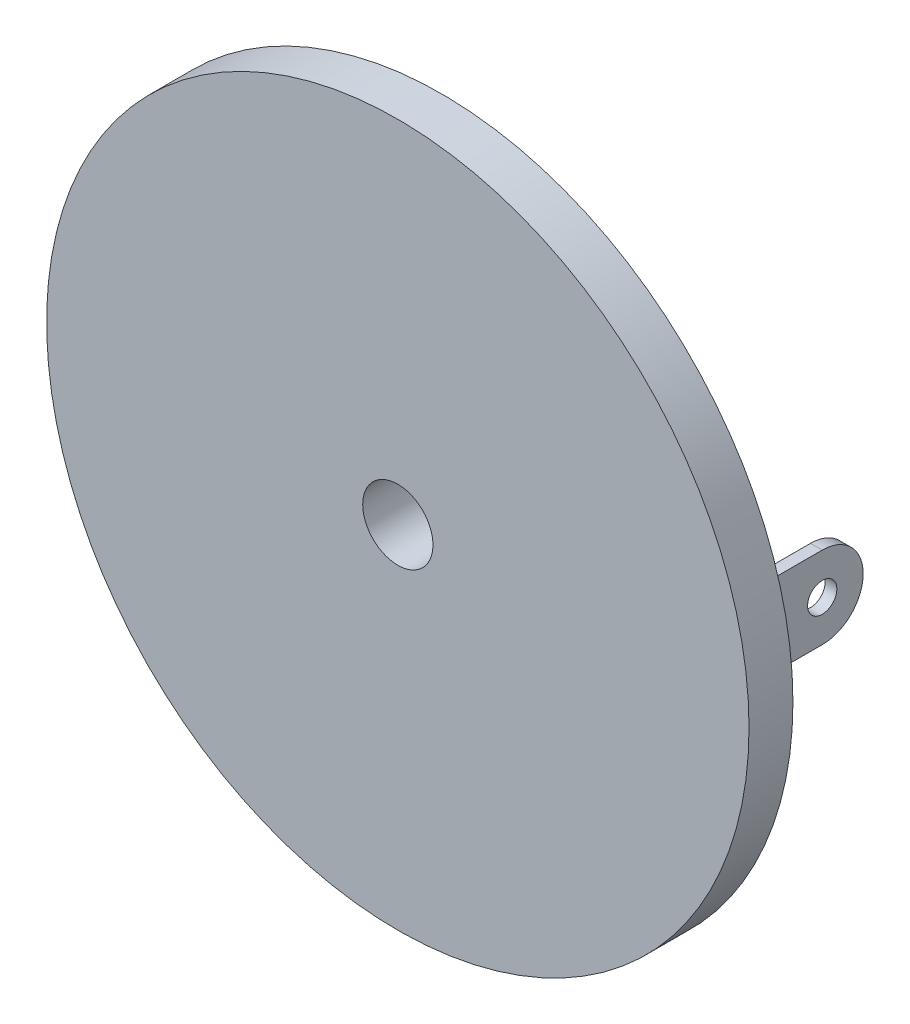
ISO-10303-21;
HEADER;
FILE_DESCRIPTION(('STEP AP214'),'2;1');
FILE_NAME('part.step','',(''),(''),'','','');
FILE_SCHEMA(('AUTOMOTIVE_DESIGN { 1 0 10303 214 1 1 1 1 }'));
ENDSEC;
DATA;
#1=APPLICATION_CONTEXT('core data for automotive mechanical design processes');
#2=APPLICATION_PROTOCOL_DEFINITION('international standard','automotive_design',2000,#1);
#3=PRODUCT_CONTEXT('',#1,'mechanical');
#4=PRODUCT('Part','Part','',(#3));
#5=PRODUCT_RELATED_PRODUCT_CATEGORY('part','',(#4));
#6=PRODUCT_DEFINITION_FORMATION('','',#4);
#7=PRODUCT_DEFINITION_CONTEXT('part definition',#1,'design');
#8=PRODUCT_DEFINITION('design','',#6,#7);
#9=PRODUCT_DEFINITION_SHAPE('','',#8);
#10=(LENGTH_UNIT() NAMED_UNIT(*) SI_UNIT(.MILLI.,.METRE.));
#11=(NAMED_UNIT(*) PLANE_ANGLE_UNIT() SI_UNIT($,.RADIAN.));
#12=(NAMED_UNIT(*) SI_UNIT($,.STERADIAN.) SOLID_ANGLE_UNIT());
#13=UNCERTAINTY_MEASURE_WITH_UNIT(LENGTH_MEASURE(1.E-05),#10,'distance_accuracy_value','');
#14=(GEOMETRIC_REPRESENTATION_CONTEXT(3) GLOBAL_UNCERTAINTY_ASSIGNED_CONTEXT((#13)) GLOBAL_UNIT_ASSIGNED_CONTEXT((#10,
#11,#12)) REPRESENTATION_CONTEXT('',''));
#15=CARTESIAN_POINT('',(0.,0.,0.));
#16=DIRECTION('',(0.,0.,1.));
#17=DIRECTION('',(1.,0.,0.));
#18=AXIS2_PLACEMENT_3D('',#15,#16,#17);
#19=CARTESIAN_POINT('',(0.,0.,0.));
#20=DIRECTION('',(0.,0.,1.));
#21=DIRECTION('',(1.,0.,0.));
#22=AXIS2_PLACEMENT_3D('',#19,#20,#21);
#23=PLANE('',#22);
#24=DIRECTION('',(0.,1.,0.));
#25=VECTOR('',#24,1.);
#26=CARTESIAN_POINT('',(-9.4,1.4,0.));
#27=LINE('',#26,#25);
#28=CARTESIAN_POINT('',(-9.4,-1.4,0.));
#29=VERTEX_POINT('',#28);
#30=CARTESIAN_POINT('',(-9.4,1.4,0.));
#31=VERTEX_POINT('',#30);
#32=EDGE_CURVE('E218',#29,#31,#27,.T.);
#33=ORIENTED_EDGE('',*,*,#32,.F.);
#34=DIRECTION('',(-1.,0.,0.));
#35=VECTOR('',#34,1.);
#36=CARTESIAN_POINT('',(-9.4,-1.4,0.));
#37=LINE('',#36,#35);
#38=CARTESIAN_POINT('',(-9.,-1.4,0.));
#39=VERTEX_POINT('',#38);
#40=EDGE_CURVE('E227',#39,#29,#37,.T.);
#41=ORIENTED_EDGE('',*,*,#40,.F.);
#42=DIRECTION('',(0.,-1.,0.));
#43=VECTOR('',#42,1.);
#44=CARTESIAN_POINT('',(-9.,1.4,0.));
#45=LINE('',#44,#43);
#46=CARTESIAN_POINT('',(-9.,1.4,0.));
#47=VERTEX_POINT('',#46);
#48=EDGE_CURVE('E224',#47,#39,#45,.T.);
#49=ORIENTED_EDGE('',*,*,#48,.F.);
#50=DIRECTION('',(1.,0.,0.));
#51=VECTOR('',#50,1.);
#52=CARTESIAN_POINT('',(-9.4,1.4,0.));
#53=LINE('',#52,#51);
#54=EDGE_CURVE('E221',#31,#47,#53,.T.);
#55=ORIENTED_EDGE('',*,*,#54,.F.);
#56=EDGE_LOOP('',(#33,#41,#49,#55));
#57=FACE_BOUND('',#56,.T.);
#58=CARTESIAN_POINT('',(0.,0.,0.));
#59=DIRECTION('',(0.,0.,1.));
#60=DIRECTION('',(1.,0.,0.));
#61=AXIS2_PLACEMENT_3D('',#58,#59,#60);
#62=CIRCLE('',#61,12.);
#63=CARTESIAN_POINT('',(12.,0.,0.));
#64=VERTEX_POINT('',#63);
#65=EDGE_CURVE('E119',#64,#64,#62,.T.);
#66=ORIENTED_EDGE('',*,*,#65,.F.);
#67=EDGE_LOOP('',(#66));
#68=FACE_BOUND('',#67,.T.);
#69=DIRECTION('',(0.,-1.,0.));
#70=VECTOR('',#69,1.);
#71=CARTESIAN_POINT('',(9.4,1.4,0.));
#72=LINE('',#71,#70);
#73=CARTESIAN_POINT('',(9.4,1.4,0.));
#74=VERTEX_POINT('',#73);
#75=CARTESIAN_POINT('',(9.4,-1.4,0.));
#76=VERTEX_POINT('',#75);
#77=EDGE_CURVE('E118',#74,#76,#72,.T.);
#78=ORIENTED_EDGE('',*,*,#77,.F.);
#79=DIRECTION('',(1.,0.,0.));
#80=VECTOR('',#79,1.);
#81=CARTESIAN_POINT('',(9.4,1.4,0.));
#82=LINE('',#81,#80);
#83=CARTESIAN_POINT('',(9.,1.4,0.));
#84=VERTEX_POINT('',#83);
#85=EDGE_CURVE('E244',#84,#74,#82,.T.);
#86=ORIENTED_EDGE('',*,*,#85,.F.);
#87=DIRECTION('',(0.,1.,0.));
#88=VECTOR('',#87,1.);
#89=CARTESIAN_POINT('',(9.,1.4,0.));
#90=LINE('',#89,#88);
#91=CARTESIAN_POINT('',(9.,-1.4,0.));
#92=VERTEX_POINT('',#91);
#93=EDGE_CURVE('E241',#92,#84,#90,.T.);
#94=ORIENTED_EDGE('',*,*,#93,.F.);
#95=DIRECTION('',(-1.,0.,0.));
#96=VECTOR('',#95,1.);
#97=CARTESIAN_POINT('',(9.4,-1.4,0.));
#98=LINE('',#97,#96);
#99=EDGE_CURVE('E239',#76,#92,#98,.T.);
#100=ORIENTED_EDGE('',*,*,#99,.F.);
#101=EDGE_LOOP('',(#78,#86,#94,#100));
#102=FACE_BOUND('',#101,.T.);
#103=CARTESIAN_POINT('',(0.,0.,0.));
#104=DIRECTION('',(0.,0.,1.));
#105=DIRECTION('',(1.,0.,0.));
#106=AXIS2_PLACEMENT_3D('',#103,#104,#105);
#107=CIRCLE('',#106,4.2);
#108=CARTESIAN_POINT('',(4.2,0.,0.));
#109=VERTEX_POINT('',#108);
#110=EDGE_CURVE('E11',#109,#109,#107,.F.);
#111=ORIENTED_EDGE('',*,*,#110,.F.);
#112=EDGE_LOOP('',(#111));
#113=FACE_BOUND('',#112,.T.);
#114=ADVANCED_FACE('F32',(#57,#68,#102,#113),#23,.F.);
#115=CARTESIAN_POINT('',(0.,0.,1.5));
#116=DIRECTION('',(0.,0.,-1.));
#117=DIRECTION('',(-1.,0.,0.));
#118=AXIS2_PLACEMENT_3D('',#115,#116,#117);
#119=CYLINDRICAL_SURFACE('',#118,12.);
#120=CARTESIAN_POINT('',(0.,0.,1.5));
#121=DIRECTION('',(0.,0.,1.));
#122=DIRECTION('',(1.,0.,0.));
#123=AXIS2_PLACEMENT_3D('',#120,#121,#122);
#124=CIRCLE('',#123,12.);
#125=CARTESIAN_POINT('',(12.,0.,1.5));
#126=VERTEX_POINT('',#125);
#127=EDGE_CURVE('E41',#126,#126,#124,.T.);
#128=ORIENTED_EDGE('',*,*,#127,.F.);
#129=EDGE_LOOP('',(#128));
#130=FACE_BOUND('',#129,.T.);
#131=ORIENTED_EDGE('',*,*,#65,.T.);
#132=EDGE_LOOP('',(#131));
#133=FACE_BOUND('',#132,.T.);
#134=ADVANCED_FACE('F34',(#130,#133),#119,.T.);
#135=CARTESIAN_POINT('',(0.,0.,1.5));
#136=DIRECTION('',(0.,0.,1.));
#137=DIRECTION('',(1.,0.,0.));
#138=AXIS2_PLACEMENT_3D('',#135,#136,#137);
#139=PLANE('',#138);
#140=CARTESIAN_POINT('',(0.,0.,1.5));
#141=DIRECTION('',(0.,0.,-1.));
#142=DIRECTION('',(-1.,0.,0.));
#143=AXIS2_PLACEMENT_3D('',#140,#141,#142);
#144=CIRCLE('',#143,1.2);
#145=CARTESIAN_POINT('',(-1.2,0.,1.5));
#146=VERTEX_POINT('',#145);
#147=EDGE_CURVE('E104',#146,#146,#144,.T.);
#148=ORIENTED_EDGE('',*,*,#147,.T.);
#149=EDGE_LOOP('',(#148));
#150=FACE_BOUND('',#149,.T.);
#151=ORIENTED_EDGE('',*,*,#127,.T.);
#152=EDGE_LOOP('',(#151));
#153=FACE_BOUND('',#152,.T.);
#154=ADVANCED_FACE('F130',(#150,#153),#139,.T.);
#155=CARTESIAN_POINT('',(9.4,1.4,-5.));
#156=DIRECTION('',(-1.,0.,0.));
#157=DIRECTION('',(0.,0.,1.));
#158=AXIS2_PLACEMENT_3D('',#155,#156,#157);
#159=PLANE('',#158);
#160=CARTESIAN_POINT('',(9.4,0.,-3.6));
#161=DIRECTION('',(1.,0.,0.));
#162=DIRECTION('',(0.,0.,-1.));
#163=AXIS2_PLACEMENT_3D('',#160,#161,#162);
#164=CIRCLE('',#163,0.500000000000001);
#165=CARTESIAN_POINT('',(9.4,0.,-4.1));
#166=VERTEX_POINT('',#165);
#167=EDGE_CURVE('E206',#166,#166,#164,.T.);
#168=ORIENTED_EDGE('',*,*,#167,.F.);
#169=EDGE_LOOP('',(#168));
#170=FACE_BOUND('',#169,.T.);
#171=DIRECTION('',(0.,0.,1.));
#172=VECTOR('',#171,1.);
#173=CARTESIAN_POINT('',(9.4,-1.4,-5.));
#174=LINE('',#173,#172);
#175=CARTESIAN_POINT('',(9.4,-1.4,-3.6));
#176=VERTEX_POINT('',#175);
#177=EDGE_CURVE('E110',#176,#76,#174,.T.);
#178=ORIENTED_EDGE('',*,*,#177,.F.);
#179=CARTESIAN_POINT('',(9.4,0.,-3.6));
#180=DIRECTION('',(-1.,0.,0.));
#181=DIRECTION('',(0.,0.,-1.));
#182=AXIS2_PLACEMENT_3D('',#179,#180,#181);
#183=CIRCLE('',#182,1.4);
#184=CARTESIAN_POINT('',(9.4,1.4,-3.6));
#185=VERTEX_POINT('',#184);
#186=EDGE_CURVE('E96',#185,#176,#183,.T.);
#187=ORIENTED_EDGE('',*,*,#186,.F.);
#188=DIRECTION('',(0.,0.,1.));
#189=VECTOR('',#188,1.);
#190=CARTESIAN_POINT('',(9.4,1.4,-5.));
#191=LINE('',#190,#189);
#192=EDGE_CURVE('E246',#185,#74,#191,.T.);
#193=ORIENTED_EDGE('',*,*,#192,.T.);
#194=ORIENTED_EDGE('',*,*,#77,.T.);
#195=EDGE_LOOP('',(#178,#187,#193,#194));
#196=FACE_BOUND('',#195,.T.);
#197=ADVANCED_FACE('F116',(#170,#196),#159,.F.);
#198=CARTESIAN_POINT('',(9.4,-1.4,-5.));
#199=DIRECTION('',(0.,1.,0.));
#200=DIRECTION('',(0.,0.,1.));
#201=AXIS2_PLACEMENT_3D('',#198,#199,#200);
#202=PLANE('',#201);
#203=DIRECTION('',(0.,0.,1.));
#204=VECTOR('',#203,1.);
#205=CARTESIAN_POINT('',(9.,-1.4,-5.));
#206=LINE('',#205,#204);
#207=CARTESIAN_POINT('',(9.,-1.4,-3.6));
#208=VERTEX_POINT('',#207);
#209=EDGE_CURVE('E112',#208,#92,#206,.T.);
#210=ORIENTED_EDGE('',*,*,#209,.F.);
#211=DIRECTION('',(1.,0.,0.));
#212=VECTOR('',#211,1.);
#213=CARTESIAN_POINT('',(-12.,-1.4,-3.6));
#214=LINE('',#213,#212);
#215=EDGE_CURVE('E99',#208,#176,#214,.T.);
#216=ORIENTED_EDGE('',*,*,#215,.T.);
#217=ORIENTED_EDGE('',*,*,#177,.T.);
#218=ORIENTED_EDGE('',*,*,#99,.T.);
#219=EDGE_LOOP('',(#210,#216,#217,#218));
#220=FACE_BOUND('',#219,.T.);
#221=ADVANCED_FACE('F108',(#220),#202,.F.);
#222=CARTESIAN_POINT('',(9.,1.4,-5.));
#223=DIRECTION('',(1.,0.,0.));
#224=DIRECTION('',(0.,0.,-1.));
#225=AXIS2_PLACEMENT_3D('',#222,#223,#224);
#226=PLANE('',#225);
#227=CARTESIAN_POINT('',(9.,0.,-3.6));
#228=DIRECTION('',(1.,0.,0.));
#229=DIRECTION('',(0.,0.,-1.));
#230=AXIS2_PLACEMENT_3D('',#227,#228,#229);
#231=CIRCLE('',#230,0.500000000000001);
#232=CARTESIAN_POINT('',(9.,0.,-4.1));
#233=VERTEX_POINT('',#232);
#234=EDGE_CURVE('E212',#233,#233,#231,.T.);
#235=ORIENTED_EDGE('',*,*,#234,.T.);
#236=EDGE_LOOP('',(#235));
#237=FACE_BOUND('',#236,.T.);
#238=DIRECTION('',(0.,0.,1.));
#239=VECTOR('',#238,1.);
#240=CARTESIAN_POINT('',(9.,1.4,-5.));
#241=LINE('',#240,#239);
#242=CARTESIAN_POINT('',(9.,1.4,-3.6));
#243=VERTEX_POINT('',#242);
#244=EDGE_CURVE('E123',#243,#84,#241,.T.);
#245=ORIENTED_EDGE('',*,*,#244,.F.);
#246=CARTESIAN_POINT('',(9.,0.,-3.6));
#247=DIRECTION('',(1.,0.,0.));
#248=DIRECTION('',(0.,0.,-1.));
#249=AXIS2_PLACEMENT_3D('',#246,#247,#248);
#250=CIRCLE('',#249,1.4);
#251=EDGE_CURVE('E48',#243,#208,#250,.F.);
#252=ORIENTED_EDGE('',*,*,#251,.T.);
#253=ORIENTED_EDGE('',*,*,#209,.T.);
#254=ORIENTED_EDGE('',*,*,#93,.T.);
#255=EDGE_LOOP('',(#245,#252,#253,#254));
#256=FACE_BOUND('',#255,.T.);
#257=ADVANCED_FACE('F178',(#237,#256),#226,.F.);
#258=CARTESIAN_POINT('',(9.4,1.4,-5.));
#259=DIRECTION('',(0.,-1.,0.));
#260=DIRECTION('',(0.,0.,-1.));
#261=AXIS2_PLACEMENT_3D('',#258,#259,#260);
#262=PLANE('',#261);
#263=ORIENTED_EDGE('',*,*,#192,.F.);
#264=DIRECTION('',(1.,0.,0.));
#265=VECTOR('',#264,1.);
#266=CARTESIAN_POINT('',(-12.,1.4,-3.6));
#267=LINE('',#266,#265);
#268=EDGE_CURVE('E100',#243,#185,#267,.T.);
#269=ORIENTED_EDGE('',*,*,#268,.F.);
#270=ORIENTED_EDGE('',*,*,#244,.T.);
#271=ORIENTED_EDGE('',*,*,#85,.T.);
#272=EDGE_LOOP('',(#263,#269,#270,#271));
#273=FACE_BOUND('',#272,.T.);
#274=ADVANCED_FACE('F174',(#273),#262,.F.);
#275=CARTESIAN_POINT('',(-9.4,1.4,-5.));
#276=DIRECTION('',(1.,0.,0.));
#277=DIRECTION('',(0.,0.,-1.));
#278=AXIS2_PLACEMENT_3D('',#275,#276,#277);
#279=PLANE('',#278);
#280=CARTESIAN_POINT('',(-9.4,0.,-3.6));
#281=DIRECTION('',(1.,0.,0.));
#282=DIRECTION('',(0.,0.,-1.));
#283=AXIS2_PLACEMENT_3D('',#280,#281,#282);
#284=CIRCLE('',#283,0.500000000000001);
#285=CARTESIAN_POINT('',(-9.4,0.,-4.1));
#286=VERTEX_POINT('',#285);
#287=EDGE_CURVE('E209',#286,#286,#284,.T.);
#288=ORIENTED_EDGE('',*,*,#287,.T.);
#289=EDGE_LOOP('',(#288));
#290=FACE_BOUND('',#289,.T.);
#291=DIRECTION('',(0.,0.,1.));
#292=VECTOR('',#291,1.);
#293=CARTESIAN_POINT('',(-9.4,1.4,-5.));
#294=LINE('',#293,#292);
#295=CARTESIAN_POINT('',(-9.4,1.4,-3.6));
#296=VERTEX_POINT('',#295);
#297=EDGE_CURVE('E236',#296,#31,#294,.T.);
#298=ORIENTED_EDGE('',*,*,#297,.F.);
#299=CARTESIAN_POINT('',(-9.4,0.,-3.6));
#300=DIRECTION('',(1.,0.,0.));
#301=DIRECTION('',(0.,0.,-1.));
#302=AXIS2_PLACEMENT_3D('',#299,#300,#301);
#303=CIRCLE('',#302,1.4);
#304=CARTESIAN_POINT('',(-9.4,-1.4,-3.6));
#305=VERTEX_POINT('',#304);
#306=EDGE_CURVE('E202',#296,#305,#303,.F.);
#307=ORIENTED_EDGE('',*,*,#306,.T.);
#308=DIRECTION('',(0.,0.,1.));
#309=VECTOR('',#308,1.);
#310=CARTESIAN_POINT('',(-9.4,-1.4,-5.));
#311=LINE('',#310,#309);
#312=EDGE_CURVE('E230',#305,#29,#311,.T.);
#313=ORIENTED_EDGE('',*,*,#312,.T.);
#314=ORIENTED_EDGE('',*,*,#32,.T.);
#315=EDGE_LOOP('',(#298,#307,#313,#314));
#316=FACE_BOUND('',#315,.T.);
#317=ADVANCED_FACE('F170',(#290,#316),#279,.F.);
#318=CARTESIAN_POINT('',(-9.4,1.4,-5.));
#319=DIRECTION('',(0.,-1.,0.));
#320=DIRECTION('',(0.,0.,-1.));
#321=AXIS2_PLACEMENT_3D('',#318,#319,#320);
#322=PLANE('',#321);
#323=DIRECTION('',(0.,0.,1.));
#324=VECTOR('',#323,1.);
#325=CARTESIAN_POINT('',(-9.,1.4,-5.));
#326=LINE('',#325,#324);
#327=CARTESIAN_POINT('',(-9.,1.4,-3.6));
#328=VERTEX_POINT('',#327);
#329=EDGE_CURVE('E234',#328,#47,#326,.T.);
#330=ORIENTED_EDGE('',*,*,#329,.F.);
#331=EDGE_CURVE('E199',#296,#328,#267,.T.);
#332=ORIENTED_EDGE('',*,*,#331,.F.);
#333=ORIENTED_EDGE('',*,*,#297,.T.);
#334=ORIENTED_EDGE('',*,*,#54,.T.);
#335=EDGE_LOOP('',(#330,#332,#333,#334));
#336=FACE_BOUND('',#335,.T.);
#337=ADVANCED_FACE('F166',(#336),#322,.F.);
#338=CARTESIAN_POINT('',(-9.,1.4,-5.));
#339=DIRECTION('',(-1.,0.,0.));
#340=DIRECTION('',(0.,0.,1.));
#341=AXIS2_PLACEMENT_3D('',#338,#339,#340);
#342=PLANE('',#341);
#343=CARTESIAN_POINT('',(-9.,0.,-3.6));
#344=DIRECTION('',(-1.,0.,0.));
#345=DIRECTION('',(0.,0.,1.));
#346=AXIS2_PLACEMENT_3D('',#343,#344,#345);
#347=CIRCLE('',#346,0.500000000000001);
#348=CARTESIAN_POINT('',(-9.,0.,-3.1));
#349=VERTEX_POINT('',#348);
#350=EDGE_CURVE('E36',#349,#349,#347,.T.);
#351=ORIENTED_EDGE('',*,*,#350,.T.);
#352=EDGE_LOOP('',(#351));
#353=FACE_BOUND('',#352,.T.);
#354=DIRECTION('',(0.,0.,1.));
#355=VECTOR('',#354,1.);
#356=CARTESIAN_POINT('',(-9.,-1.4,-5.));
#357=LINE('',#356,#355);
#358=CARTESIAN_POINT('',(-9.,-1.4,-3.6));
#359=VERTEX_POINT('',#358);
#360=EDGE_CURVE('E232',#359,#39,#357,.T.);
#361=ORIENTED_EDGE('',*,*,#360,.F.);
#362=CARTESIAN_POINT('',(-9.,0.,-3.6));
#363=DIRECTION('',(-1.,0.,0.));
#364=DIRECTION('',(0.,0.,1.));
#365=AXIS2_PLACEMENT_3D('',#362,#363,#364);
#366=CIRCLE('',#365,1.4);
#367=EDGE_CURVE('E56',#359,#328,#366,.F.);
#368=ORIENTED_EDGE('',*,*,#367,.T.);
#369=ORIENTED_EDGE('',*,*,#329,.T.);
#370=ORIENTED_EDGE('',*,*,#48,.T.);
#371=EDGE_LOOP('',(#361,#368,#369,#370));
#372=FACE_BOUND('',#371,.T.);
#373=ADVANCED_FACE('F158',(#353,#372),#342,.F.);
#374=CARTESIAN_POINT('',(-9.4,-1.4,-5.));
#375=DIRECTION('',(0.,1.,0.));
#376=DIRECTION('',(0.,0.,1.));
#377=AXIS2_PLACEMENT_3D('',#374,#375,#376);
#378=PLANE('',#377);
#379=ORIENTED_EDGE('',*,*,#312,.F.);
#380=EDGE_CURVE('E113',#305,#359,#214,.T.);
#381=ORIENTED_EDGE('',*,*,#380,.T.);
#382=ORIENTED_EDGE('',*,*,#360,.T.);
#383=ORIENTED_EDGE('',*,*,#40,.T.);
#384=EDGE_LOOP('',(#379,#381,#382,#383));
#385=FACE_BOUND('',#384,.T.);
#386=ADVANCED_FACE('F148',(#385),#378,.F.);
#387=CARTESIAN_POINT('',(0.,0.,-2.));
#388=DIRECTION('',(0.,0.,1.));
#389=DIRECTION('',(1.,0.,0.));
#390=AXIS2_PLACEMENT_3D('',#387,#388,#389);
#391=CYLINDRICAL_SURFACE('',#390,4.2);
#392=CARTESIAN_POINT('',(0.,0.,-2.));
#393=DIRECTION('',(0.,0.,-1.));
#394=DIRECTION('',(-1.,0.,0.));
#395=AXIS2_PLACEMENT_3D('',#392,#393,#394);
#396=CIRCLE('',#395,4.2);
#397=CARTESIAN_POINT('',(-4.2,0.,-2.));
#398=VERTEX_POINT('',#397);
#399=EDGE_CURVE('E215',#398,#398,#396,.T.);
#400=ORIENTED_EDGE('',*,*,#399,.F.);
#401=EDGE_LOOP('',(#400));
#402=FACE_BOUND('',#401,.T.);
#403=ORIENTED_EDGE('',*,*,#110,.T.);
#404=EDGE_LOOP('',(#403));
#405=FACE_BOUND('',#404,.T.);
#406=ADVANCED_FACE('F145',(#402,#405),#391,.T.);
#407=CARTESIAN_POINT('',(0.,0.,-2.));
#408=DIRECTION('',(0.,0.,-1.));
#409=DIRECTION('',(-1.,0.,0.));
#410=AXIS2_PLACEMENT_3D('',#407,#408,#409);
#411=PLANE('',#410);
#412=CARTESIAN_POINT('',(0.,0.,-2.));
#413=DIRECTION('',(0.,0.,-1.));
#414=DIRECTION('',(-1.,0.,0.));
#415=AXIS2_PLACEMENT_3D('',#412,#413,#414);
#416=CIRCLE('',#415,1.2);
#417=CARTESIAN_POINT('',(-1.2,0.,-2.));
#418=VERTEX_POINT('',#417);
#419=EDGE_CURVE('E194',#418,#418,#416,.T.);
#420=ORIENTED_EDGE('',*,*,#419,.F.);
#421=EDGE_LOOP('',(#420));
#422=FACE_BOUND('',#421,.T.);
#423=ORIENTED_EDGE('',*,*,#399,.T.);
#424=EDGE_LOOP('',(#423));
#425=FACE_BOUND('',#424,.T.);
#426=ADVANCED_FACE('F147',(#422,#425),#411,.T.);
#427=CARTESIAN_POINT('',(-12.,0.,-3.6));
#428=DIRECTION('',(1.,0.,0.));
#429=DIRECTION('',(0.,0.,-1.));
#430=AXIS2_PLACEMENT_3D('',#427,#428,#429);
#431=CYLINDRICAL_SURFACE('',#430,0.500000000000001);
#432=ORIENTED_EDGE('',*,*,#350,.F.);
#433=EDGE_LOOP('',(#432));
#434=FACE_BOUND('',#433,.T.);
#435=ORIENTED_EDGE('',*,*,#287,.F.);
#436=EDGE_LOOP('',(#435));
#437=FACE_BOUND('',#436,.T.);
#438=ADVANCED_FACE('F155',(#434,#437),#431,.F.);
#439=ORIENTED_EDGE('',*,*,#167,.T.);
#440=EDGE_LOOP('',(#439));
#441=FACE_BOUND('',#440,.T.);
#442=ORIENTED_EDGE('',*,*,#234,.F.);
#443=EDGE_LOOP('',(#442));
#444=FACE_BOUND('',#443,.T.);
#445=ADVANCED_FACE('F263',(#441,#444),#431,.F.);
#446=CARTESIAN_POINT('',(-12.,0.,-3.6));
#447=DIRECTION('',(1.,0.,0.));
#448=DIRECTION('',(0.,0.,-1.));
#449=AXIS2_PLACEMENT_3D('',#446,#447,#448);
#450=CYLINDRICAL_SURFACE('',#449,1.4);
#451=ORIENTED_EDGE('',*,*,#306,.F.);
#452=ORIENTED_EDGE('',*,*,#331,.T.);
#453=ORIENTED_EDGE('',*,*,#367,.F.);
#454=ORIENTED_EDGE('',*,*,#380,.F.);
#455=EDGE_LOOP('',(#451,#452,#453,#454));
#456=FACE_BOUND('',#455,.T.);
#457=ADVANCED_FACE('F261',(#456),#450,.T.);
#458=ORIENTED_EDGE('',*,*,#251,.F.);
#459=ORIENTED_EDGE('',*,*,#268,.T.);
#460=ORIENTED_EDGE('',*,*,#186,.T.);
#461=ORIENTED_EDGE('',*,*,#215,.F.);
#462=EDGE_LOOP('',(#458,#459,#460,#461));
#463=FACE_BOUND('',#462,.T.);
#464=ADVANCED_FACE('F98',(#463),#450,.T.);
#465=CARTESIAN_POINT('',(0.,0.,1.5));
#466=DIRECTION('',(0.,0.,-1.));
#467=DIRECTION('',(-1.,0.,0.));
#468=AXIS2_PLACEMENT_3D('',#465,#466,#467);
#469=CYLINDRICAL_SURFACE('',#468,1.2);
#470=ORIENTED_EDGE('',*,*,#147,.F.);
#471=EDGE_LOOP('',(#470));
#472=FACE_BOUND('',#471,.T.);
#473=ORIENTED_EDGE('',*,*,#419,.T.);
#474=EDGE_LOOP('',(#473));
#475=FACE_BOUND('',#474,.T.);
#476=ADVANCED_FACE('F269',(#472,#475),#469,.F.);
#477=CLOSED_SHELL('',(#114,#134,#154,#197,#221,#257,#274,#317,#337,#373,#386,#406,#426,#438,
#445,#457,#464,#476));
#478=MANIFOLD_SOLID_BREP('B2',#477);
#479=ADVANCED_BREP_SHAPE_REPRESENTATION('',(#18,#478),#14);
#480=SHAPE_DEFINITION_REPRESENTATION(#9,#479);
ENDSEC;
END-ISO-10303-21;
